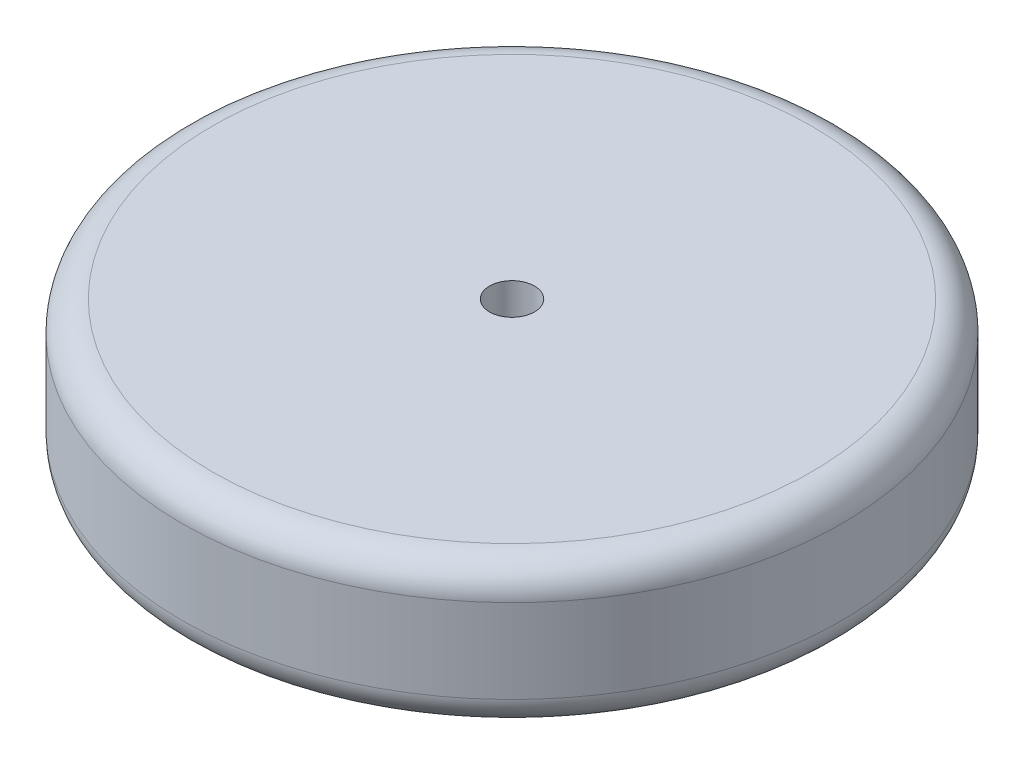
ISO-10303-21;
HEADER;
FILE_DESCRIPTION(('STEP AP214'),'2;1');
FILE_NAME('part.step','',(''),(''),'','','');
FILE_SCHEMA(('AUTOMOTIVE_DESIGN { 1 0 10303 214 1 1 1 1 }'));
ENDSEC;
DATA;
#1=APPLICATION_CONTEXT('core data for automotive mechanical design processes');
#2=APPLICATION_PROTOCOL_DEFINITION('international standard','automotive_design',2000,#1);
#3=PRODUCT_CONTEXT('',#1,'mechanical');
#4=PRODUCT('Part','Part','',(#3));
#5=PRODUCT_RELATED_PRODUCT_CATEGORY('part','',(#4));
#6=PRODUCT_DEFINITION_FORMATION('','',#4);
#7=PRODUCT_DEFINITION_CONTEXT('part definition',#1,'design');
#8=PRODUCT_DEFINITION('design','',#6,#7);
#9=PRODUCT_DEFINITION_SHAPE('','',#8);
#10=(LENGTH_UNIT() NAMED_UNIT(*) SI_UNIT(.MILLI.,.METRE.));
#11=(NAMED_UNIT(*) PLANE_ANGLE_UNIT() SI_UNIT($,.RADIAN.));
#12=(NAMED_UNIT(*) SI_UNIT($,.STERADIAN.) SOLID_ANGLE_UNIT());
#13=UNCERTAINTY_MEASURE_WITH_UNIT(LENGTH_MEASURE(1.E-05),#10,'distance_accuracy_value','');
#14=(GEOMETRIC_REPRESENTATION_CONTEXT(3) GLOBAL_UNCERTAINTY_ASSIGNED_CONTEXT((#13)) GLOBAL_UNIT_ASSIGNED_CONTEXT((#10,
#11,#12)) REPRESENTATION_CONTEXT('',''));
#15=CARTESIAN_POINT('',(0.,0.,0.));
#16=DIRECTION('',(0.,0.,1.));
#17=DIRECTION('',(1.,0.,0.));
#18=AXIS2_PLACEMENT_3D('',#15,#16,#17);
#19=CARTESIAN_POINT('',(0.,15.24,0.));
#20=DIRECTION('',(0.,-1.,0.));
#21=DIRECTION('',(0.,0.,-1.));
#22=AXIS2_PLACEMENT_3D('',#19,#20,#21);
#23=CYLINDRICAL_SURFACE('',#22,69.85);
#24=CARTESIAN_POINT('',(0.,-8.89,0.));
#25=DIRECTION('',(0.,1.,0.));
#26=DIRECTION('',(0.,0.,1.));
#27=AXIS2_PLACEMENT_3D('',#24,#25,#26);
#28=CIRCLE('',#27,69.85);
#29=CARTESIAN_POINT('',(0.,-8.89,69.85));
#30=VERTEX_POINT('',#29);
#31=EDGE_CURVE('E46',#30,#30,#28,.T.);
#32=ORIENTED_EDGE('',*,*,#31,.T.);
#33=EDGE_LOOP('',(#32));
#34=FACE_BOUND('',#33,.T.);
#35=CARTESIAN_POINT('',(0.,8.89,0.));
#36=DIRECTION('',(0.,1.,0.));
#37=DIRECTION('',(0.,0.,1.));
#38=AXIS2_PLACEMENT_3D('',#35,#36,#37);
#39=CIRCLE('',#38,69.85);
#40=CARTESIAN_POINT('',(0.,8.89,69.85));
#41=VERTEX_POINT('',#40);
#42=EDGE_CURVE('E50',#41,#41,#39,.F.);
#43=ORIENTED_EDGE('',*,*,#42,.T.);
#44=EDGE_LOOP('',(#43));
#45=FACE_BOUND('',#44,.T.);
#46=ADVANCED_FACE('F35',(#34,#45),#23,.T.);
#47=CARTESIAN_POINT('',(0.,15.24,0.));
#48=DIRECTION('',(0.,1.,0.));
#49=DIRECTION('',(0.,0.,1.));
#50=AXIS2_PLACEMENT_3D('',#47,#48,#49);
#51=PLANE('',#50);
#52=CARTESIAN_POINT('',(0.,15.24,0.));
#53=DIRECTION('',(0.,1.,0.));
#54=DIRECTION('',(0.,0.,1.));
#55=AXIS2_PLACEMENT_3D('',#52,#53,#54);
#56=CIRCLE('',#55,63.5);
#57=CARTESIAN_POINT('',(0.,15.24,63.5));
#58=VERTEX_POINT('',#57);
#59=EDGE_CURVE('E10',#58,#58,#56,.T.);
#60=ORIENTED_EDGE('',*,*,#59,.T.);
#61=EDGE_LOOP('',(#60));
#62=FACE_BOUND('',#61,.T.);
#63=CARTESIAN_POINT('',(0.,15.24,0.));
#64=DIRECTION('',(0.,1.,0.));
#65=DIRECTION('',(0.,0.,1.));
#66=AXIS2_PLACEMENT_3D('',#63,#64,#65);
#67=CIRCLE('',#66,4.7625);
#68=CARTESIAN_POINT('',(0.,15.24,4.7625));
#69=VERTEX_POINT('',#68);
#70=EDGE_CURVE('E56',#69,#69,#67,.T.);
#71=ORIENTED_EDGE('',*,*,#70,.F.);
#72=EDGE_LOOP('',(#71));
#73=FACE_BOUND('',#72,.T.);
#74=ADVANCED_FACE('F71',(#62,#73),#51,.T.);
#75=CARTESIAN_POINT('',(0.,-15.24,0.));
#76=DIRECTION('',(0.,1.,0.));
#77=DIRECTION('',(0.,0.,1.));
#78=AXIS2_PLACEMENT_3D('',#75,#76,#77);
#79=PLANE('',#78);
#80=CARTESIAN_POINT('',(0.,-15.24,0.));
#81=DIRECTION('',(0.,1.,0.));
#82=DIRECTION('',(0.,0.,1.));
#83=AXIS2_PLACEMENT_3D('',#80,#81,#82);
#84=CIRCLE('',#83,63.5);
#85=CARTESIAN_POINT('',(0.,-15.24,63.5));
#86=VERTEX_POINT('',#85);
#87=EDGE_CURVE('E42',#86,#86,#84,.F.);
#88=ORIENTED_EDGE('',*,*,#87,.T.);
#89=EDGE_LOOP('',(#88));
#90=FACE_BOUND('',#89,.T.);
#91=CARTESIAN_POINT('',(0.,-15.24,0.));
#92=DIRECTION('',(0.,1.,0.));
#93=DIRECTION('',(0.,0.,1.));
#94=AXIS2_PLACEMENT_3D('',#91,#92,#93);
#95=CIRCLE('',#94,4.7625);
#96=CARTESIAN_POINT('',(0.,-15.24,4.7625));
#97=VERTEX_POINT('',#96);
#98=EDGE_CURVE('E55',#97,#97,#95,.T.);
#99=ORIENTED_EDGE('',*,*,#98,.T.);
#100=EDGE_LOOP('',(#99));
#101=FACE_BOUND('',#100,.T.);
#102=ADVANCED_FACE('F62',(#90,#101),#79,.F.);
#103=CARTESIAN_POINT('',(0.,-15.24,0.));
#104=DIRECTION('',(0.,1.,0.));
#105=DIRECTION('',(0.,0.,1.));
#106=AXIS2_PLACEMENT_3D('',#103,#104,#105);
#107=CYLINDRICAL_SURFACE('',#106,4.7625);
#108=ORIENTED_EDGE('',*,*,#98,.F.);
#109=EDGE_LOOP('',(#108));
#110=FACE_BOUND('',#109,.T.);
#111=ORIENTED_EDGE('',*,*,#70,.T.);
#112=EDGE_LOOP('',(#111));
#113=FACE_BOUND('',#112,.T.);
#114=ADVANCED_FACE('F64',(#110,#113),#107,.F.);
#115=CARTESIAN_POINT('',(0.,-8.89,0.));
#116=DIRECTION('',(0.,1.,0.));
#117=DIRECTION('',(0.,0.,1.));
#118=AXIS2_PLACEMENT_3D('',#115,#116,#117);
#119=TOROIDAL_SURFACE('',#118,63.5,6.35);
#120=ORIENTED_EDGE('',*,*,#87,.F.);
#121=EDGE_LOOP('',(#120));
#122=FACE_BOUND('',#121,.T.);
#123=ORIENTED_EDGE('',*,*,#31,.F.);
#124=EDGE_LOOP('',(#123));
#125=FACE_BOUND('',#124,.T.);
#126=ADVANCED_FACE('F67',(#122,#125),#119,.T.);
#127=CARTESIAN_POINT('',(0.,8.89,0.));
#128=DIRECTION('',(0.,1.,0.));
#129=DIRECTION('',(0.,0.,1.));
#130=AXIS2_PLACEMENT_3D('',#127,#128,#129);
#131=TOROIDAL_SURFACE('',#130,63.5,6.35);
#132=ORIENTED_EDGE('',*,*,#42,.F.);
#133=EDGE_LOOP('',(#132));
#134=FACE_BOUND('',#133,.T.);
#135=ORIENTED_EDGE('',*,*,#59,.F.);
#136=EDGE_LOOP('',(#135));
#137=FACE_BOUND('',#136,.T.);
#138=ADVANCED_FACE('F37',(#134,#137),#131,.T.);
#139=CLOSED_SHELL('',(#46,#74,#102,#114,#126,#138));
#140=MANIFOLD_SOLID_BREP('B2',#139);
#141=ADVANCED_BREP_SHAPE_REPRESENTATION('',(#18,#140),#14);
#142=SHAPE_DEFINITION_REPRESENTATION(#9,#141);
ENDSEC;
END-ISO-10303-21;
